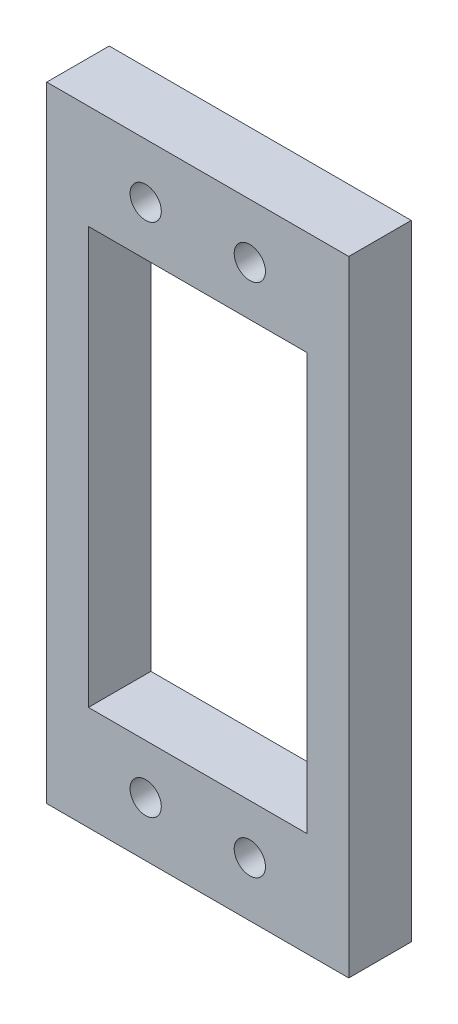
ISO-10303-21;
HEADER;
FILE_DESCRIPTION(('STEP AP214'),'2;1');
FILE_NAME('part.step','',(''),(''),'','','');
FILE_SCHEMA(('AUTOMOTIVE_DESIGN { 1 0 10303 214 1 1 1 1 }'));
ENDSEC;
DATA;
#1=APPLICATION_CONTEXT('core data for automotive mechanical design processes');
#2=APPLICATION_PROTOCOL_DEFINITION('international standard','automotive_design',2000,#1);
#3=PRODUCT_CONTEXT('',#1,'mechanical');
#4=PRODUCT('Part','Part','',(#3));
#5=PRODUCT_RELATED_PRODUCT_CATEGORY('part','',(#4));
#6=PRODUCT_DEFINITION_FORMATION('','',#4);
#7=PRODUCT_DEFINITION_CONTEXT('part definition',#1,'design');
#8=PRODUCT_DEFINITION('design','',#6,#7);
#9=PRODUCT_DEFINITION_SHAPE('','',#8);
#10=(LENGTH_UNIT() NAMED_UNIT(*) SI_UNIT(.MILLI.,.METRE.));
#11=(NAMED_UNIT(*) PLANE_ANGLE_UNIT() SI_UNIT($,.RADIAN.));
#12=(NAMED_UNIT(*) SI_UNIT($,.STERADIAN.) SOLID_ANGLE_UNIT());
#13=UNCERTAINTY_MEASURE_WITH_UNIT(LENGTH_MEASURE(1.E-05),#10,'distance_accuracy_value','');
#14=(GEOMETRIC_REPRESENTATION_CONTEXT(3) GLOBAL_UNCERTAINTY_ASSIGNED_CONTEXT((#13)) GLOBAL_UNIT_ASSIGNED_CONTEXT((#10,
#11,#12)) REPRESENTATION_CONTEXT('',''));
#15=CARTESIAN_POINT('',(0.,0.,0.));
#16=DIRECTION('',(0.,0.,1.));
#17=DIRECTION('',(1.,0.,0.));
#18=AXIS2_PLACEMENT_3D('',#15,#16,#17);
#19=CARTESIAN_POINT('',(0.,-30.,6.));
#20=DIRECTION('',(0.,1.,0.));
#21=DIRECTION('',(0.,0.,1.));
#22=AXIS2_PLACEMENT_3D('',#19,#20,#21);
#23=PLANE('',#22);
#24=DIRECTION('',(1.,0.,0.));
#25=VECTOR('',#24,1.);
#26=CARTESIAN_POINT('',(0.,-30.,0.));
#27=LINE('',#26,#25);
#28=CARTESIAN_POINT('',(-14.5,-30.,0.));
#29=VERTEX_POINT('',#28);
#30=CARTESIAN_POINT('',(14.5,-30.,0.));
#31=VERTEX_POINT('',#30);
#32=EDGE_CURVE('E154',#29,#31,#27,.T.);
#33=ORIENTED_EDGE('',*,*,#32,.T.);
#34=DIRECTION('',(0.,0.,-1.));
#35=VECTOR('',#34,1.);
#36=CARTESIAN_POINT('',(14.5,-30.,6.));
#37=LINE('',#36,#35);
#38=CARTESIAN_POINT('',(14.5,-30.,6.));
#39=VERTEX_POINT('',#38);
#40=EDGE_CURVE('E11',#39,#31,#37,.T.);
#41=ORIENTED_EDGE('',*,*,#40,.F.);
#42=DIRECTION('',(1.,0.,0.));
#43=VECTOR('',#42,1.);
#44=CARTESIAN_POINT('',(0.,-30.,6.));
#45=LINE('',#44,#43);
#46=CARTESIAN_POINT('',(-14.5,-30.,6.));
#47=VERTEX_POINT('',#46);
#48=EDGE_CURVE('E113',#47,#39,#45,.T.);
#49=ORIENTED_EDGE('',*,*,#48,.F.);
#50=DIRECTION('',(0.,0.,-1.));
#51=VECTOR('',#50,1.);
#52=CARTESIAN_POINT('',(-14.5,-30.,6.));
#53=LINE('',#52,#51);
#54=EDGE_CURVE('E52',#47,#29,#53,.T.);
#55=ORIENTED_EDGE('',*,*,#54,.T.);
#56=EDGE_LOOP('',(#33,#41,#49,#55));
#57=FACE_BOUND('',#56,.T.);
#58=ADVANCED_FACE('F33',(#57),#23,.F.);
#59=CARTESIAN_POINT('',(14.5,0.,6.));
#60=DIRECTION('',(-1.,0.,0.));
#61=DIRECTION('',(0.,0.,1.));
#62=AXIS2_PLACEMENT_3D('',#59,#60,#61);
#63=PLANE('',#62);
#64=DIRECTION('',(0.,1.,0.));
#65=VECTOR('',#64,1.);
#66=CARTESIAN_POINT('',(14.5,0.,0.));
#67=LINE('',#66,#65);
#68=CARTESIAN_POINT('',(14.5,30.,0.));
#69=VERTEX_POINT('',#68);
#70=EDGE_CURVE('E119',#31,#69,#67,.T.);
#71=ORIENTED_EDGE('',*,*,#70,.T.);
#72=DIRECTION('',(0.,0.,-1.));
#73=VECTOR('',#72,1.);
#74=CARTESIAN_POINT('',(14.5,30.,6.));
#75=LINE('',#74,#73);
#76=CARTESIAN_POINT('',(14.5,30.,6.));
#77=VERTEX_POINT('',#76);
#78=EDGE_CURVE('E43',#77,#69,#75,.T.);
#79=ORIENTED_EDGE('',*,*,#78,.F.);
#80=DIRECTION('',(0.,1.,0.));
#81=VECTOR('',#80,1.);
#82=CARTESIAN_POINT('',(14.5,0.,6.));
#83=LINE('',#82,#81);
#84=EDGE_CURVE('E106',#39,#77,#83,.T.);
#85=ORIENTED_EDGE('',*,*,#84,.F.);
#86=ORIENTED_EDGE('',*,*,#40,.T.);
#87=EDGE_LOOP('',(#71,#79,#85,#86));
#88=FACE_BOUND('',#87,.T.);
#89=ADVANCED_FACE('F118',(#88),#63,.F.);
#90=CARTESIAN_POINT('',(0.,30.,6.));
#91=DIRECTION('',(0.,1.,0.));
#92=DIRECTION('',(0.,0.,1.));
#93=AXIS2_PLACEMENT_3D('',#90,#91,#92);
#94=PLANE('',#93);
#95=DIRECTION('',(1.,0.,0.));
#96=VECTOR('',#95,1.);
#97=CARTESIAN_POINT('',(0.,30.,0.));
#98=LINE('',#97,#96);
#99=CARTESIAN_POINT('',(-14.5,30.,0.));
#100=VERTEX_POINT('',#99);
#101=EDGE_CURVE('E157',#100,#69,#98,.T.);
#102=ORIENTED_EDGE('',*,*,#101,.F.);
#103=DIRECTION('',(0.,0.,-1.));
#104=VECTOR('',#103,1.);
#105=CARTESIAN_POINT('',(-14.5,30.,6.));
#106=LINE('',#105,#104);
#107=CARTESIAN_POINT('',(-14.5,30.,6.));
#108=VERTEX_POINT('',#107);
#109=EDGE_CURVE('E78',#108,#100,#106,.T.);
#110=ORIENTED_EDGE('',*,*,#109,.F.);
#111=DIRECTION('',(1.,0.,0.));
#112=VECTOR('',#111,1.);
#113=CARTESIAN_POINT('',(0.,30.,6.));
#114=LINE('',#113,#112);
#115=EDGE_CURVE('E112',#108,#77,#114,.T.);
#116=ORIENTED_EDGE('',*,*,#115,.T.);
#117=ORIENTED_EDGE('',*,*,#78,.T.);
#118=EDGE_LOOP('',(#102,#110,#116,#117));
#119=FACE_BOUND('',#118,.T.);
#120=ADVANCED_FACE('F123',(#119),#94,.T.);
#121=CARTESIAN_POINT('',(10.5,0.,6.));
#122=DIRECTION('',(-1.,0.,0.));
#123=DIRECTION('',(0.,-1.,0.));
#124=AXIS2_PLACEMENT_3D('',#121,#122,#123);
#125=PLANE('',#124);
#126=DIRECTION('',(0.,1.,0.));
#127=VECTOR('',#126,1.);
#128=CARTESIAN_POINT('',(10.5,0.,0.));
#129=LINE('',#128,#127);
#130=CARTESIAN_POINT('',(10.5,-20.,0.));
#131=VERTEX_POINT('',#130);
#132=CARTESIAN_POINT('',(10.5,20.,0.));
#133=VERTEX_POINT('',#132);
#134=EDGE_CURVE('E142',#131,#133,#129,.T.);
#135=ORIENTED_EDGE('',*,*,#134,.F.);
#136=DIRECTION('',(0.,0.,-1.));
#137=VECTOR('',#136,1.);
#138=CARTESIAN_POINT('',(10.5,-20.,6.));
#139=LINE('',#138,#137);
#140=CARTESIAN_POINT('',(10.5,-20.,6.));
#141=VERTEX_POINT('',#140);
#142=EDGE_CURVE('E37',#141,#131,#139,.T.);
#143=ORIENTED_EDGE('',*,*,#142,.F.);
#144=DIRECTION('',(0.,1.,0.));
#145=VECTOR('',#144,1.);
#146=CARTESIAN_POINT('',(10.5,0.,6.));
#147=LINE('',#146,#145);
#148=CARTESIAN_POINT('',(10.5,20.,6.));
#149=VERTEX_POINT('',#148);
#150=EDGE_CURVE('E199',#141,#149,#147,.T.);
#151=ORIENTED_EDGE('',*,*,#150,.T.);
#152=DIRECTION('',(0.,0.,-1.));
#153=VECTOR('',#152,1.);
#154=CARTESIAN_POINT('',(10.5,20.,6.));
#155=LINE('',#154,#153);
#156=EDGE_CURVE('E135',#149,#133,#155,.T.);
#157=ORIENTED_EDGE('',*,*,#156,.T.);
#158=EDGE_LOOP('',(#135,#143,#151,#157));
#159=FACE_BOUND('',#158,.T.);
#160=ADVANCED_FACE('F184',(#159),#125,.T.);
#161=CARTESIAN_POINT('',(0.,-20.,6.));
#162=DIRECTION('',(0.,1.,0.));
#163=DIRECTION('',(0.,0.,1.));
#164=AXIS2_PLACEMENT_3D('',#161,#162,#163);
#165=PLANE('',#164);
#166=DIRECTION('',(1.,0.,0.));
#167=VECTOR('',#166,1.);
#168=CARTESIAN_POINT('',(0.,-20.,0.));
#169=LINE('',#168,#167);
#170=CARTESIAN_POINT('',(-10.5,-20.,0.));
#171=VERTEX_POINT('',#170);
#172=EDGE_CURVE('E145',#171,#131,#169,.T.);
#173=ORIENTED_EDGE('',*,*,#172,.F.);
#174=DIRECTION('',(0.,0.,-1.));
#175=VECTOR('',#174,1.);
#176=CARTESIAN_POINT('',(-10.5,-20.,6.));
#177=LINE('',#176,#175);
#178=CARTESIAN_POINT('',(-10.5,-20.,6.));
#179=VERTEX_POINT('',#178);
#180=EDGE_CURVE('E174',#179,#171,#177,.T.);
#181=ORIENTED_EDGE('',*,*,#180,.F.);
#182=DIRECTION('',(1.,0.,0.));
#183=VECTOR('',#182,1.);
#184=CARTESIAN_POINT('',(0.,-20.,6.));
#185=LINE('',#184,#183);
#186=EDGE_CURVE('E183',#179,#141,#185,.T.);
#187=ORIENTED_EDGE('',*,*,#186,.T.);
#188=ORIENTED_EDGE('',*,*,#142,.T.);
#189=EDGE_LOOP('',(#173,#181,#187,#188));
#190=FACE_BOUND('',#189,.T.);
#191=ADVANCED_FACE('F181',(#190),#165,.T.);
#192=CARTESIAN_POINT('',(-10.5,0.,6.));
#193=DIRECTION('',(-1.,0.,0.));
#194=DIRECTION('',(0.,-1.,0.));
#195=AXIS2_PLACEMENT_3D('',#192,#193,#194);
#196=PLANE('',#195);
#197=DIRECTION('',(0.,1.,0.));
#198=VECTOR('',#197,1.);
#199=CARTESIAN_POINT('',(-10.5,0.,0.));
#200=LINE('',#199,#198);
#201=CARTESIAN_POINT('',(-10.5,20.,0.));
#202=VERTEX_POINT('',#201);
#203=EDGE_CURVE('E148',#171,#202,#200,.T.);
#204=ORIENTED_EDGE('',*,*,#203,.T.);
#205=DIRECTION('',(0.,0.,-1.));
#206=VECTOR('',#205,1.);
#207=CARTESIAN_POINT('',(-10.5,20.,6.));
#208=LINE('',#207,#206);
#209=CARTESIAN_POINT('',(-10.5,20.,6.));
#210=VERTEX_POINT('',#209);
#211=EDGE_CURVE('E172',#210,#202,#208,.T.);
#212=ORIENTED_EDGE('',*,*,#211,.F.);
#213=DIRECTION('',(0.,1.,0.));
#214=VECTOR('',#213,1.);
#215=CARTESIAN_POINT('',(-10.5,0.,6.));
#216=LINE('',#215,#214);
#217=EDGE_CURVE('E192',#179,#210,#216,.T.);
#218=ORIENTED_EDGE('',*,*,#217,.F.);
#219=ORIENTED_EDGE('',*,*,#180,.T.);
#220=EDGE_LOOP('',(#204,#212,#218,#219));
#221=FACE_BOUND('',#220,.T.);
#222=ADVANCED_FACE('F190',(#221),#196,.F.);
#223=CARTESIAN_POINT('',(5.,-24.75,6.));
#224=DIRECTION('',(0.,0.,-1.));
#225=DIRECTION('',(-1.,0.,0.));
#226=AXIS2_PLACEMENT_3D('',#223,#224,#225);
#227=CYLINDRICAL_SURFACE('',#226,1.5);
#228=CARTESIAN_POINT('',(5.,-24.75,6.));
#229=DIRECTION('',(0.,0.,1.));
#230=DIRECTION('',(1.,0.,0.));
#231=AXIS2_PLACEMENT_3D('',#228,#229,#230);
#232=CIRCLE('',#231,1.5);
#233=CARTESIAN_POINT('',(6.5,-24.75,6.));
#234=VERTEX_POINT('',#233);
#235=EDGE_CURVE('E126',#234,#234,#232,.T.);
#236=ORIENTED_EDGE('',*,*,#235,.T.);
#237=EDGE_LOOP('',(#236));
#238=FACE_BOUND('',#237,.T.);
#239=CARTESIAN_POINT('',(5.,-24.75,0.));
#240=DIRECTION('',(0.,0.,1.));
#241=DIRECTION('',(1.,0.,0.));
#242=AXIS2_PLACEMENT_3D('',#239,#240,#241);
#243=CIRCLE('',#242,1.5);
#244=CARTESIAN_POINT('',(6.5,-24.75,0.));
#245=VERTEX_POINT('',#244);
#246=EDGE_CURVE('E162',#245,#245,#243,.T.);
#247=ORIENTED_EDGE('',*,*,#246,.F.);
#248=EDGE_LOOP('',(#247));
#249=FACE_BOUND('',#248,.T.);
#250=ADVANCED_FACE('F240',(#238,#249),#227,.F.);
#251=CARTESIAN_POINT('',(-14.5,0.,6.));
#252=DIRECTION('',(-1.,0.,0.));
#253=DIRECTION('',(0.,0.,1.));
#254=AXIS2_PLACEMENT_3D('',#251,#252,#253);
#255=PLANE('',#254);
#256=DIRECTION('',(0.,1.,0.));
#257=VECTOR('',#256,1.);
#258=CARTESIAN_POINT('',(-14.5,0.,0.));
#259=LINE('',#258,#257);
#260=EDGE_CURVE('E159',#29,#100,#259,.T.);
#261=ORIENTED_EDGE('',*,*,#260,.F.);
#262=ORIENTED_EDGE('',*,*,#54,.F.);
#263=DIRECTION('',(0.,1.,0.));
#264=VECTOR('',#263,1.);
#265=CARTESIAN_POINT('',(-14.5,0.,6.));
#266=LINE('',#265,#264);
#267=EDGE_CURVE('E124',#47,#108,#266,.T.);
#268=ORIENTED_EDGE('',*,*,#267,.T.);
#269=ORIENTED_EDGE('',*,*,#109,.T.);
#270=EDGE_LOOP('',(#261,#262,#268,#269));
#271=FACE_BOUND('',#270,.T.);
#272=ADVANCED_FACE('F227',(#271),#255,.T.);
#273=CARTESIAN_POINT('',(0.,20.,6.));
#274=DIRECTION('',(0.,1.,0.));
#275=DIRECTION('',(0.,0.,1.));
#276=AXIS2_PLACEMENT_3D('',#273,#274,#275);
#277=PLANE('',#276);
#278=DIRECTION('',(1.,0.,0.));
#279=VECTOR('',#278,1.);
#280=CARTESIAN_POINT('',(0.,20.,0.));
#281=LINE('',#280,#279);
#282=EDGE_CURVE('E151',#202,#133,#281,.T.);
#283=ORIENTED_EDGE('',*,*,#282,.T.);
#284=ORIENTED_EDGE('',*,*,#156,.F.);
#285=DIRECTION('',(1.,0.,0.));
#286=VECTOR('',#285,1.);
#287=CARTESIAN_POINT('',(0.,20.,6.));
#288=LINE('',#287,#286);
#289=EDGE_CURVE('E195',#210,#149,#288,.T.);
#290=ORIENTED_EDGE('',*,*,#289,.F.);
#291=ORIENTED_EDGE('',*,*,#211,.T.);
#292=EDGE_LOOP('',(#283,#284,#290,#291));
#293=FACE_BOUND('',#292,.T.);
#294=ADVANCED_FACE('F194',(#293),#277,.F.);
#295=CARTESIAN_POINT('',(-5.,24.75,6.));
#296=DIRECTION('',(0.,0.,-1.));
#297=DIRECTION('',(-1.,0.,0.));
#298=AXIS2_PLACEMENT_3D('',#295,#296,#297);
#299=CYLINDRICAL_SURFACE('',#298,1.5);
#300=CARTESIAN_POINT('',(-5.,24.75,6.));
#301=DIRECTION('',(0.,0.,1.));
#302=DIRECTION('',(1.,0.,0.));
#303=AXIS2_PLACEMENT_3D('',#300,#301,#302);
#304=CIRCLE('',#303,1.5);
#305=CARTESIAN_POINT('',(-3.5,24.75,6.));
#306=VERTEX_POINT('',#305);
#307=EDGE_CURVE('E203',#306,#306,#304,.T.);
#308=ORIENTED_EDGE('',*,*,#307,.T.);
#309=EDGE_LOOP('',(#308));
#310=FACE_BOUND('',#309,.T.);
#311=CARTESIAN_POINT('',(-5.,24.75,0.));
#312=DIRECTION('',(0.,0.,1.));
#313=DIRECTION('',(1.,0.,0.));
#314=AXIS2_PLACEMENT_3D('',#311,#312,#313);
#315=CIRCLE('',#314,1.5);
#316=CARTESIAN_POINT('',(-3.5,24.75,0.));
#317=VERTEX_POINT('',#316);
#318=EDGE_CURVE('E139',#317,#317,#315,.T.);
#319=ORIENTED_EDGE('',*,*,#318,.F.);
#320=EDGE_LOOP('',(#319));
#321=FACE_BOUND('',#320,.T.);
#322=ADVANCED_FACE('F214',(#310,#321),#299,.F.);
#323=CARTESIAN_POINT('',(5.,24.75,6.));
#324=DIRECTION('',(0.,0.,-1.));
#325=DIRECTION('',(-1.,0.,0.));
#326=AXIS2_PLACEMENT_3D('',#323,#324,#325);
#327=CYLINDRICAL_SURFACE('',#326,1.5);
#328=CARTESIAN_POINT('',(5.,24.75,6.));
#329=DIRECTION('',(0.,0.,1.));
#330=DIRECTION('',(1.,0.,0.));
#331=AXIS2_PLACEMENT_3D('',#328,#329,#330);
#332=CIRCLE('',#331,1.5);
#333=CARTESIAN_POINT('',(6.5,24.75,6.));
#334=VERTEX_POINT('',#333);
#335=EDGE_CURVE('E168',#334,#334,#332,.F.);
#336=ORIENTED_EDGE('',*,*,#335,.F.);
#337=EDGE_LOOP('',(#336));
#338=FACE_BOUND('',#337,.T.);
#339=CARTESIAN_POINT('',(5.,24.75,0.));
#340=DIRECTION('',(0.,0.,1.));
#341=DIRECTION('',(1.,0.,0.));
#342=AXIS2_PLACEMENT_3D('',#339,#340,#341);
#343=CIRCLE('',#342,1.5);
#344=CARTESIAN_POINT('',(6.5,24.75,0.));
#345=VERTEX_POINT('',#344);
#346=EDGE_CURVE('E136',#345,#345,#343,.F.);
#347=ORIENTED_EDGE('',*,*,#346,.T.);
#348=EDGE_LOOP('',(#347));
#349=FACE_BOUND('',#348,.T.);
#350=ADVANCED_FACE('F35',(#338,#349),#327,.F.);
#351=CARTESIAN_POINT('',(-5.,-24.75,6.));
#352=DIRECTION('',(0.,0.,-1.));
#353=DIRECTION('',(-1.,0.,0.));
#354=AXIS2_PLACEMENT_3D('',#351,#352,#353);
#355=CYLINDRICAL_SURFACE('',#354,1.5);
#356=CARTESIAN_POINT('',(-5.,-24.75,6.));
#357=DIRECTION('',(0.,0.,1.));
#358=DIRECTION('',(1.,0.,0.));
#359=AXIS2_PLACEMENT_3D('',#356,#357,#358);
#360=CIRCLE('',#359,1.5);
#361=CARTESIAN_POINT('',(-3.5,-24.75,6.));
#362=VERTEX_POINT('',#361);
#363=EDGE_CURVE('E132',#362,#362,#360,.F.);
#364=ORIENTED_EDGE('',*,*,#363,.F.);
#365=EDGE_LOOP('',(#364));
#366=FACE_BOUND('',#365,.T.);
#367=CARTESIAN_POINT('',(-5.,-24.75,0.));
#368=DIRECTION('',(0.,0.,1.));
#369=DIRECTION('',(1.,0.,0.));
#370=AXIS2_PLACEMENT_3D('',#367,#368,#369);
#371=CIRCLE('',#370,1.5);
#372=CARTESIAN_POINT('',(-3.5,-24.75,0.));
#373=VERTEX_POINT('',#372);
#374=EDGE_CURVE('E165',#373,#373,#371,.F.);
#375=ORIENTED_EDGE('',*,*,#374,.T.);
#376=EDGE_LOOP('',(#375));
#377=FACE_BOUND('',#376,.T.);
#378=ADVANCED_FACE('F213',(#366,#377),#355,.F.);
#379=CARTESIAN_POINT('',(0.,0.,6.));
#380=DIRECTION('',(0.,0.,1.));
#381=DIRECTION('',(1.,0.,0.));
#382=AXIS2_PLACEMENT_3D('',#379,#380,#381);
#383=PLANE('',#382);
#384=ORIENTED_EDGE('',*,*,#335,.T.);
#385=EDGE_LOOP('',(#384));
#386=FACE_BOUND('',#385,.T.);
#387=ORIENTED_EDGE('',*,*,#307,.F.);
#388=EDGE_LOOP('',(#387));
#389=FACE_BOUND('',#388,.T.);
#390=ORIENTED_EDGE('',*,*,#150,.F.);
#391=ORIENTED_EDGE('',*,*,#186,.F.);
#392=ORIENTED_EDGE('',*,*,#217,.T.);
#393=ORIENTED_EDGE('',*,*,#289,.T.);
#394=EDGE_LOOP('',(#390,#391,#392,#393));
#395=FACE_BOUND('',#394,.T.);
#396=ORIENTED_EDGE('',*,*,#48,.T.);
#397=ORIENTED_EDGE('',*,*,#84,.T.);
#398=ORIENTED_EDGE('',*,*,#115,.F.);
#399=ORIENTED_EDGE('',*,*,#267,.F.);
#400=EDGE_LOOP('',(#396,#397,#398,#399));
#401=FACE_BOUND('',#400,.T.);
#402=ORIENTED_EDGE('',*,*,#235,.F.);
#403=EDGE_LOOP('',(#402));
#404=FACE_BOUND('',#403,.T.);
#405=ORIENTED_EDGE('',*,*,#363,.T.);
#406=EDGE_LOOP('',(#405));
#407=FACE_BOUND('',#406,.T.);
#408=ADVANCED_FACE('F108',(#386,#389,#395,#401,#404,#407),#383,.T.);
#409=CARTESIAN_POINT('',(0.,0.,0.));
#410=DIRECTION('',(0.,0.,1.));
#411=DIRECTION('',(1.,0.,0.));
#412=AXIS2_PLACEMENT_3D('',#409,#410,#411);
#413=PLANE('',#412);
#414=ORIENTED_EDGE('',*,*,#346,.F.);
#415=EDGE_LOOP('',(#414));
#416=FACE_BOUND('',#415,.T.);
#417=ORIENTED_EDGE('',*,*,#318,.T.);
#418=EDGE_LOOP('',(#417));
#419=FACE_BOUND('',#418,.T.);
#420=ORIENTED_EDGE('',*,*,#134,.T.);
#421=ORIENTED_EDGE('',*,*,#282,.F.);
#422=ORIENTED_EDGE('',*,*,#203,.F.);
#423=ORIENTED_EDGE('',*,*,#172,.T.);
#424=EDGE_LOOP('',(#420,#421,#422,#423));
#425=FACE_BOUND('',#424,.T.);
#426=ORIENTED_EDGE('',*,*,#32,.F.);
#427=ORIENTED_EDGE('',*,*,#260,.T.);
#428=ORIENTED_EDGE('',*,*,#101,.T.);
#429=ORIENTED_EDGE('',*,*,#70,.F.);
#430=EDGE_LOOP('',(#426,#427,#428,#429));
#431=FACE_BOUND('',#430,.T.);
#432=ORIENTED_EDGE('',*,*,#246,.T.);
#433=EDGE_LOOP('',(#432));
#434=FACE_BOUND('',#433,.T.);
#435=ORIENTED_EDGE('',*,*,#374,.F.);
#436=EDGE_LOOP('',(#435));
#437=FACE_BOUND('',#436,.T.);
#438=ADVANCED_FACE('F187',(#416,#419,#425,#431,#434,#437),#413,.F.);
#439=CLOSED_SHELL('',(#58,#89,#120,#160,#191,#222,#250,#272,#294,#322,#350,#378,#408,#438));
#440=MANIFOLD_SOLID_BREP('B2',#439);
#441=ADVANCED_BREP_SHAPE_REPRESENTATION('',(#18,#440),#14);
#442=SHAPE_DEFINITION_REPRESENTATION(#9,#441);
ENDSEC;
END-ISO-10303-21;
